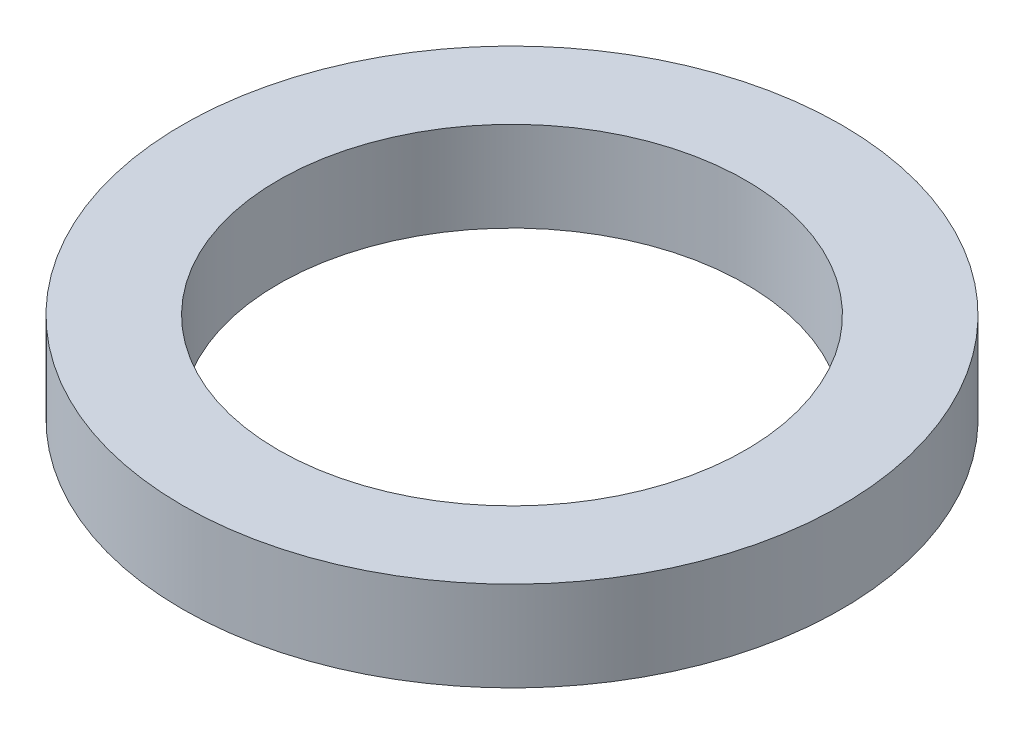
ISO-10303-21;
HEADER;
FILE_DESCRIPTION(('STEP AP214'),'2;1');
FILE_NAME('part.step','',(''),(''),'','','');
FILE_SCHEMA(('AUTOMOTIVE_DESIGN { 1 0 10303 214 1 1 1 1 }'));
ENDSEC;
DATA;
#1=APPLICATION_CONTEXT('core data for automotive mechanical design processes');
#2=APPLICATION_PROTOCOL_DEFINITION('international standard','automotive_design',2000,#1);
#3=PRODUCT_CONTEXT('',#1,'mechanical');
#4=PRODUCT('Part','Part','',(#3));
#5=PRODUCT_RELATED_PRODUCT_CATEGORY('part','',(#4));
#6=PRODUCT_DEFINITION_FORMATION('','',#4);
#7=PRODUCT_DEFINITION_CONTEXT('part definition',#1,'design');
#8=PRODUCT_DEFINITION('design','',#6,#7);
#9=PRODUCT_DEFINITION_SHAPE('','',#8);
#10=(LENGTH_UNIT() NAMED_UNIT(*) SI_UNIT(.MILLI.,.METRE.));
#11=(NAMED_UNIT(*) PLANE_ANGLE_UNIT() SI_UNIT($,.RADIAN.));
#12=(NAMED_UNIT(*) SI_UNIT($,.STERADIAN.) SOLID_ANGLE_UNIT());
#13=UNCERTAINTY_MEASURE_WITH_UNIT(LENGTH_MEASURE(1.E-05),#10,'distance_accuracy_value','');
#14=(GEOMETRIC_REPRESENTATION_CONTEXT(3) GLOBAL_UNCERTAINTY_ASSIGNED_CONTEXT((#13)) GLOBAL_UNIT_ASSIGNED_CONTEXT((#10,
#11,#12)) REPRESENTATION_CONTEXT('',''));
#15=CARTESIAN_POINT('',(0.,0.,0.));
#16=DIRECTION('',(0.,0.,1.));
#17=DIRECTION('',(1.,0.,0.));
#18=AXIS2_PLACEMENT_3D('',#15,#16,#17);
#19=CARTESIAN_POINT('',(0.,3.81,0.));
#20=DIRECTION('',(0.,1.,0.));
#21=DIRECTION('',(0.,0.,1.));
#22=AXIS2_PLACEMENT_3D('',#19,#20,#21);
#23=PLANE('',#22);
#24=CARTESIAN_POINT('',(0.,3.81,0.));
#25=DIRECTION('',(0.,1.,0.));
#26=DIRECTION('',(0.,0.,1.));
#27=AXIS2_PLACEMENT_3D('',#24,#25,#26);
#28=CIRCLE('',#27,13.97);
#29=CARTESIAN_POINT('',(0.,3.81,13.97));
#30=VERTEX_POINT('',#29);
#31=EDGE_CURVE('E10',#30,#30,#28,.T.);
#32=ORIENTED_EDGE('',*,*,#31,.T.);
#33=EDGE_LOOP('',(#32));
#34=FACE_BOUND('',#33,.T.);
#35=CARTESIAN_POINT('',(0.,3.81,0.));
#36=DIRECTION('',(0.,1.,0.));
#37=DIRECTION('',(0.,0.,1.));
#38=AXIS2_PLACEMENT_3D('',#35,#36,#37);
#39=CIRCLE('',#38,9.906);
#40=CARTESIAN_POINT('',(0.,3.81,9.906));
#41=VERTEX_POINT('',#40);
#42=EDGE_CURVE('E54',#41,#41,#39,.T.);
#43=ORIENTED_EDGE('',*,*,#42,.F.);
#44=EDGE_LOOP('',(#43));
#45=FACE_BOUND('',#44,.T.);
#46=ADVANCED_FACE('F41',(#34,#45),#23,.T.);
#47=CARTESIAN_POINT('',(0.,0.,0.));
#48=DIRECTION('',(0.,1.,0.));
#49=DIRECTION('',(0.,0.,1.));
#50=AXIS2_PLACEMENT_3D('',#47,#48,#49);
#51=PLANE('',#50);
#52=CARTESIAN_POINT('',(0.,0.,0.));
#53=DIRECTION('',(0.,1.,0.));
#54=DIRECTION('',(0.,0.,1.));
#55=AXIS2_PLACEMENT_3D('',#52,#53,#54);
#56=CIRCLE('',#55,13.97);
#57=CARTESIAN_POINT('',(0.,0.,13.97));
#58=VERTEX_POINT('',#57);
#59=EDGE_CURVE('E45',#58,#58,#56,.T.);
#60=ORIENTED_EDGE('',*,*,#59,.F.);
#61=EDGE_LOOP('',(#60));
#62=FACE_BOUND('',#61,.T.);
#63=CARTESIAN_POINT('',(0.,0.,0.));
#64=DIRECTION('',(0.,1.,0.));
#65=DIRECTION('',(0.,0.,1.));
#66=AXIS2_PLACEMENT_3D('',#63,#64,#65);
#67=CIRCLE('',#66,9.906);
#68=CARTESIAN_POINT('',(0.,0.,9.906));
#69=VERTEX_POINT('',#68);
#70=EDGE_CURVE('E56',#69,#69,#67,.T.);
#71=ORIENTED_EDGE('',*,*,#70,.T.);
#72=EDGE_LOOP('',(#71));
#73=FACE_BOUND('',#72,.T.);
#74=ADVANCED_FACE('F68',(#62,#73),#51,.F.);
#75=CARTESIAN_POINT('',(0.,3.81,0.));
#76=DIRECTION('',(0.,-1.,0.));
#77=DIRECTION('',(0.,0.,-1.));
#78=AXIS2_PLACEMENT_3D('',#75,#76,#77);
#79=CYLINDRICAL_SURFACE('',#78,13.97);
#80=ORIENTED_EDGE('',*,*,#31,.F.);
#81=EDGE_LOOP('',(#80));
#82=FACE_BOUND('',#81,.T.);
#83=ORIENTED_EDGE('',*,*,#59,.T.);
#84=EDGE_LOOP('',(#83));
#85=FACE_BOUND('',#84,.T.);
#86=ADVANCED_FACE('F43',(#82,#85),#79,.T.);
#87=CARTESIAN_POINT('',(0.,3.81,0.));
#88=DIRECTION('',(0.,-1.,0.));
#89=DIRECTION('',(0.,0.,-1.));
#90=AXIS2_PLACEMENT_3D('',#87,#88,#89);
#91=CYLINDRICAL_SURFACE('',#90,9.906);
#92=ORIENTED_EDGE('',*,*,#42,.T.);
#93=EDGE_LOOP('',(#92));
#94=FACE_BOUND('',#93,.T.);
#95=ORIENTED_EDGE('',*,*,#70,.F.);
#96=EDGE_LOOP('',(#95));
#97=FACE_BOUND('',#96,.T.);
#98=ADVANCED_FACE('F64',(#94,#97),#91,.F.);
#99=CLOSED_SHELL('',(#46,#74,#86,#98));
#100=MANIFOLD_SOLID_BREP('B2',#99);
#101=ADVANCED_BREP_SHAPE_REPRESENTATION('',(#18,#100),#14);
#102=SHAPE_DEFINITION_REPRESENTATION(#9,#101);
ENDSEC;
END-ISO-10303-21;
